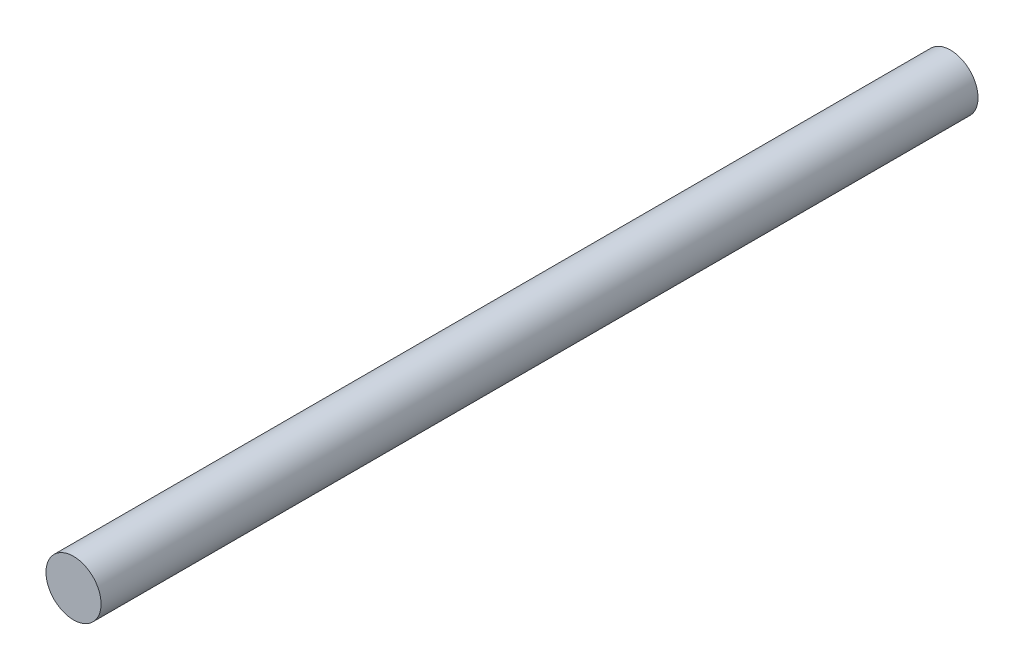
ISO-10303-21;
HEADER;
FILE_DESCRIPTION(('STEP AP214'),'2;1');
FILE_NAME('part.step','',(''),(''),'','','');
FILE_SCHEMA(('AUTOMOTIVE_DESIGN { 1 0 10303 214 1 1 1 1 }'));
ENDSEC;
DATA;
#1=APPLICATION_CONTEXT('core data for automotive mechanical design processes');
#2=APPLICATION_PROTOCOL_DEFINITION('international standard','automotive_design',2000,#1);
#3=PRODUCT_CONTEXT('',#1,'mechanical');
#4=PRODUCT('Part','Part','',(#3));
#5=PRODUCT_RELATED_PRODUCT_CATEGORY('part','',(#4));
#6=PRODUCT_DEFINITION_FORMATION('','',#4);
#7=PRODUCT_DEFINITION_CONTEXT('part definition',#1,'design');
#8=PRODUCT_DEFINITION('design','',#6,#7);
#9=PRODUCT_DEFINITION_SHAPE('','',#8);
#10=(LENGTH_UNIT() NAMED_UNIT(*) SI_UNIT(.MILLI.,.METRE.));
#11=(NAMED_UNIT(*) PLANE_ANGLE_UNIT() SI_UNIT($,.RADIAN.));
#12=(NAMED_UNIT(*) SI_UNIT($,.STERADIAN.) SOLID_ANGLE_UNIT());
#13=UNCERTAINTY_MEASURE_WITH_UNIT(LENGTH_MEASURE(1.E-05),#10,'distance_accuracy_value','');
#14=(GEOMETRIC_REPRESENTATION_CONTEXT(3) GLOBAL_UNCERTAINTY_ASSIGNED_CONTEXT((#13)) GLOBAL_UNIT_ASSIGNED_CONTEXT((#10,
#11,#12)) REPRESENTATION_CONTEXT('',''));
#15=CARTESIAN_POINT('',(0.,0.,0.));
#16=DIRECTION('',(0.,0.,1.));
#17=DIRECTION('',(1.,0.,0.));
#18=AXIS2_PLACEMENT_3D('',#15,#16,#17);
#19=CARTESIAN_POINT('',(-7.78120604781998,9.56078904991949,70.));
#20=DIRECTION('',(0.,0.,-1.));
#21=DIRECTION('',(-1.,0.,0.));
#22=AXIS2_PLACEMENT_3D('',#19,#20,#21);
#23=CYLINDRICAL_SURFACE('',#22,2.2);
#24=CARTESIAN_POINT('',(-7.78120604781998,9.56078904991949,70.));
#25=DIRECTION('',(0.,0.,1.));
#26=DIRECTION('',(1.,0.,0.));
#27=AXIS2_PLACEMENT_3D('',#24,#25,#26);
#28=CIRCLE('',#27,2.2);
#29=CARTESIAN_POINT('',(-5.58120604781998,9.56078904991949,70.));
#30=VERTEX_POINT('',#29);
#31=EDGE_CURVE('E10',#30,#30,#28,.T.);
#32=ORIENTED_EDGE('',*,*,#31,.F.);
#33=EDGE_LOOP('',(#32));
#34=FACE_BOUND('',#33,.T.);
#35=CARTESIAN_POINT('',(-7.78120604781998,9.56078904991949,0.));
#36=DIRECTION('',(0.,0.,1.));
#37=DIRECTION('',(1.,0.,0.));
#38=AXIS2_PLACEMENT_3D('',#35,#36,#37);
#39=CIRCLE('',#38,2.2);
#40=CARTESIAN_POINT('',(-5.58120604781998,9.56078904991949,0.));
#41=VERTEX_POINT('',#40);
#42=EDGE_CURVE('E34',#41,#41,#39,.T.);
#43=ORIENTED_EDGE('',*,*,#42,.T.);
#44=EDGE_LOOP('',(#43));
#45=FACE_BOUND('',#44,.T.);
#46=ADVANCED_FACE('F31',(#34,#45),#23,.T.);
#47=CARTESIAN_POINT('',(-7.78120604781998,9.56078904991949,70.));
#48=DIRECTION('',(0.,0.,1.));
#49=DIRECTION('',(1.,0.,0.));
#50=AXIS2_PLACEMENT_3D('',#47,#48,#49);
#51=PLANE('',#50);
#52=ORIENTED_EDGE('',*,*,#31,.T.);
#53=EDGE_LOOP('',(#52));
#54=FACE_BOUND('',#53,.T.);
#55=ADVANCED_FACE('F46',(#54),#51,.T.);
#56=CARTESIAN_POINT('',(-7.78120604781998,9.56078904991949,0.));
#57=DIRECTION('',(0.,0.,1.));
#58=DIRECTION('',(1.,0.,0.));
#59=AXIS2_PLACEMENT_3D('',#56,#57,#58);
#60=PLANE('',#59);
#61=ORIENTED_EDGE('',*,*,#42,.F.);
#62=EDGE_LOOP('',(#61));
#63=FACE_BOUND('',#62,.T.);
#64=ADVANCED_FACE('F44',(#63),#60,.F.);
#65=CLOSED_SHELL('',(#46,#55,#64));
#66=MANIFOLD_SOLID_BREP('B2',#65);
#67=ADVANCED_BREP_SHAPE_REPRESENTATION('',(#18,#66),#14);
#68=SHAPE_DEFINITION_REPRESENTATION(#9,#67);
ENDSEC;
END-ISO-10303-21;
